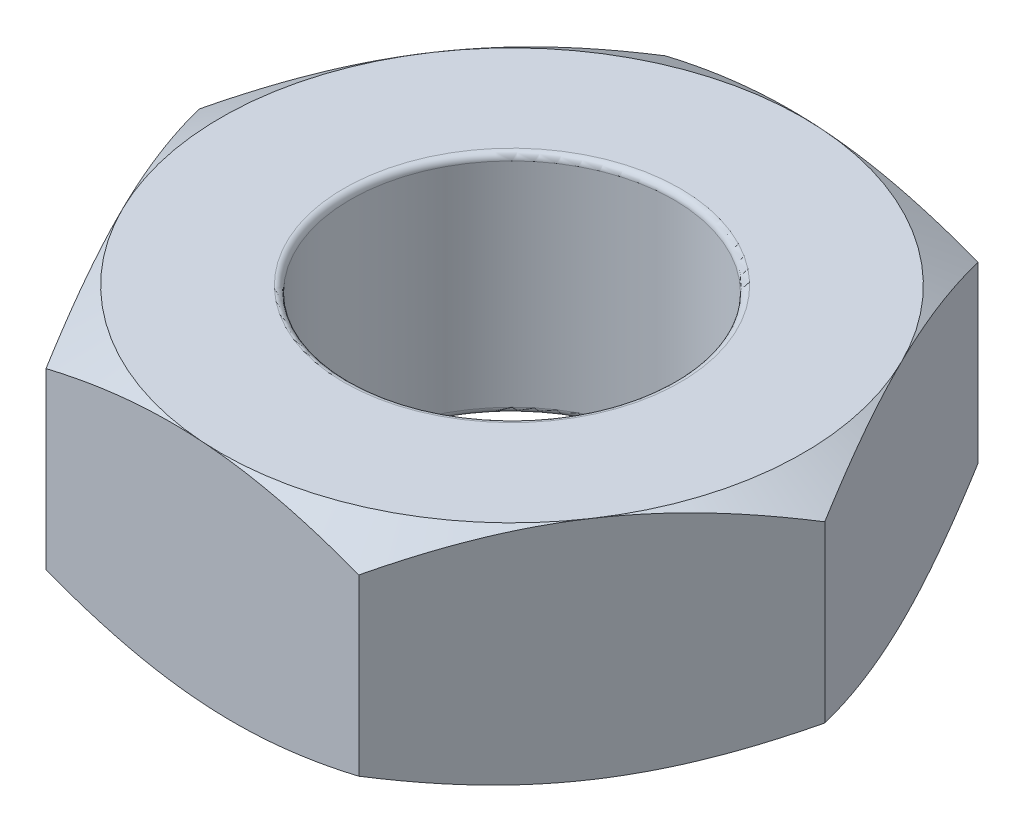
ISO-10303-21;
HEADER;
FILE_DESCRIPTION(('STEP AP214'),'2;1');
FILE_NAME('part.step','',(''),(''),'','','');
FILE_SCHEMA(('AUTOMOTIVE_DESIGN { 1 0 10303 214 1 1 1 1 }'));
ENDSEC;
DATA;
#1=APPLICATION_CONTEXT('core data for automotive mechanical design processes');
#2=APPLICATION_PROTOCOL_DEFINITION('international standard','automotive_design',2000,#1);
#3=PRODUCT_CONTEXT('',#1,'mechanical');
#4=PRODUCT('Part','Part','',(#3));
#5=PRODUCT_RELATED_PRODUCT_CATEGORY('part','',(#4));
#6=PRODUCT_DEFINITION_FORMATION('','',#4);
#7=PRODUCT_DEFINITION_CONTEXT('part definition',#1,'design');
#8=PRODUCT_DEFINITION('design','',#6,#7);
#9=PRODUCT_DEFINITION_SHAPE('','',#8);
#10=(LENGTH_UNIT() NAMED_UNIT(*) SI_UNIT(.MILLI.,.METRE.));
#11=(NAMED_UNIT(*) PLANE_ANGLE_UNIT() SI_UNIT($,.RADIAN.));
#12=(NAMED_UNIT(*) SI_UNIT($,.STERADIAN.) SOLID_ANGLE_UNIT());
#13=UNCERTAINTY_MEASURE_WITH_UNIT(LENGTH_MEASURE(1.E-05),#10,'distance_accuracy_value','');
#14=(GEOMETRIC_REPRESENTATION_CONTEXT(3) GLOBAL_UNCERTAINTY_ASSIGNED_CONTEXT((#13)) GLOBAL_UNIT_ASSIGNED_CONTEXT((#10,
#11,#12)) REPRESENTATION_CONTEXT('',''));
#15=CARTESIAN_POINT('',(0.,0.,0.));
#16=DIRECTION('',(0.,0.,1.));
#17=DIRECTION('',(1.,0.,0.));
#18=AXIS2_PLACEMENT_3D('',#15,#16,#17);
#19=CARTESIAN_POINT('',(-1.146252882548,1.75,-2.33154548084536));
#20=DIRECTION('',(0.830790431180641,0.,0.556585356848961));
#21=DIRECTION('',(0.556585356848961,0.,-0.830790431180641));
#22=AXIS2_PLACEMENT_3D('',#19,#20,#21);
#23=PLANE('',#22);
#24=CARTESIAN_POINT('',(-2.5924380471167,0.201031393244862,-0.172888624974969));
#25=CARTESIAN_POINT('',(-2.52889059428543,0.168058173631026,-0.267743107020657));
#26=CARTESIAN_POINT('',(-2.46479460574027,0.138069884332893,-0.363416364150261));
#27=CARTESIAN_POINT('',(-2.33549266517128,0.0857242251932143,-0.556419671973457));
#28=CARTESIAN_POINT('',(-2.27028441508464,0.0633853747016226,-0.653753152884119));
#29=CARTESIAN_POINT('',(-2.14067607597745,0.028610605846782,-0.847213808301055));
#30=CARTESIAN_POINT('',(-2.07629593248273,0.0159432615544224,-0.943311211));
#31=CARTESIAN_POINT('',(-1.94723260791653,0.000819191728099685,-1.13595834723262));
#32=CARTESIAN_POINT('',(-1.88254989617233,-0.00165005583573603,-1.23250738022215));
#33=CARTESIAN_POINT('',(-1.76167952783556,0.00347803138658858,-1.4129252517881));
#34=CARTESIAN_POINT('',(-1.70547380685891,0.0098162441579589,-1.49682105427448));
#35=CARTESIAN_POINT('',(-1.59342855687802,0.0299073942311841,-1.66406606062958));
#36=CARTESIAN_POINT('',(-1.53758941561701,0.0436671992850212,-1.74741468573109));
#37=CARTESIAN_POINT('',(-1.42531301997605,0.0780667237739584,-1.91500471302546));
#38=CARTESIAN_POINT('',(-1.36888998099337,0.0988523083950956,-1.99922489652135));
#39=CARTESIAN_POINT('',(-1.25688559532257,0.146027824736778,-2.16640890652184));
#40=CARTESIAN_POINT('',(-1.20130281291877,0.172406666845707,-2.24937487605596));
#41=CARTESIAN_POINT('',(-1.14611889319618,0.201031393244862,-2.33174548084536));
#42=B_SPLINE_CURVE_WITH_KNOTS('',3,(#24,#25,#26,#27,#28,#29,#30,#31,#32,#33,#34,#35,#36,#37,#38,
#39,#40,#41),.UNSPECIFIED.,.F.,.F.,(4,2,2,2,2,2,2,2,4),(0.,0.356659496712157,0.714176462982408,
1.0628443844209,1.41108405628949,1.71434084543148,2.01787874333305,2.32815094453625,
2.63781363483916),.UNSPECIFIED.);
#43=CARTESIAN_POINT('',(-2.59230405776488,0.200961894323341,-0.173088624974969));
#44=VERTEX_POINT('',#43);
#45=CARTESIAN_POINT('',(-1.86927847015644,0.,-1.25231705291016));
#46=VERTEX_POINT('',#45);
#47=EDGE_CURVE('E67',#44,#46,#42,.T.);
#48=ORIENTED_EDGE('',*,*,#47,.F.);
#49=DIRECTION('',(0.,-1.,0.));
#50=VECTOR('',#49,1.);
#51=CARTESIAN_POINT('',(-2.59230405776488,1.75,-0.173088624974969));
#52=LINE('',#51,#50);
#53=CARTESIAN_POINT('',(-2.59230405776488,1.54903810567666,-0.173088624974969));
#54=VERTEX_POINT('',#53);
#55=EDGE_CURVE('E301',#54,#44,#52,.T.);
#56=ORIENTED_EDGE('',*,*,#55,.F.);
#57=CARTESIAN_POINT('',(-1.14611889319618,1.54896860675514,-2.33174548084536));
#58=CARTESIAN_POINT('',(-1.20966634602745,1.58194182636897,-2.23689099879967));
#59=CARTESIAN_POINT('',(-1.27376233457261,1.61193011566711,-2.14121774167006));
#60=CARTESIAN_POINT('',(-1.4030642751416,1.66427577480679,-1.94821443384687));
#61=CARTESIAN_POINT('',(-1.46827252522824,1.68661462529838,-1.85088095293621));
#62=CARTESIAN_POINT('',(-1.59788086433543,1.72138939415322,-1.65742029751927));
#63=CARTESIAN_POINT('',(-1.66226100783015,1.73405673844558,-1.56132289482033));
#64=CARTESIAN_POINT('',(-1.79132433239635,1.7491808082719,-1.36867575858771));
#65=CARTESIAN_POINT('',(-1.85600704414056,1.75165005583574,-1.27212672559818));
#66=CARTESIAN_POINT('',(-1.97687741247732,1.74652196861341,-1.09170885403223));
#67=CARTESIAN_POINT('',(-2.03308313345398,1.74018375584204,-1.00781305154584));
#68=CARTESIAN_POINT('',(-2.14512838343486,1.72009260576882,-0.840568045190744));
#69=CARTESIAN_POINT('',(-2.20096752469587,1.70633280071498,-0.757219420089231));
#70=CARTESIAN_POINT('',(-2.31324392033683,1.67193327622604,-0.589629392794869));
#71=CARTESIAN_POINT('',(-2.36966695931951,1.6511476916049,-0.505409209298979));
#72=CARTESIAN_POINT('',(-2.48167134499032,1.60397217526322,-0.338225199298481));
#73=CARTESIAN_POINT('',(-2.53725412739411,1.57759333315429,-0.255259229764361));
#74=CARTESIAN_POINT('',(-2.5924380471167,1.54896860675514,-0.172888624974969));
#75=B_SPLINE_CURVE_WITH_KNOTS('',3,(#57,#58,#59,#60,#61,#62,#63,#64,#65,#66,#67,#68,#69,#70,#71,
#72,#73,#74),.UNSPECIFIED.,.F.,.F.,(4,2,2,2,2,2,2,2,4),(0.,0.356659496712157,0.714176462982408,
1.0628443844209,1.41108405628949,1.71434084543148,2.01787874333305,2.32815094453625,
2.63781363483916),.UNSPECIFIED.);
#76=CARTESIAN_POINT('',(-1.86927847015644,1.75,-1.25231705291016));
#77=VERTEX_POINT('',#76);
#78=EDGE_CURVE('E281',#77,#54,#75,.T.);
#79=ORIENTED_EDGE('',*,*,#78,.F.);
#80=CARTESIAN_POINT('',(-1.146252882548,1.54903810567666,-2.33154548084536));
#81=VERTEX_POINT('',#80);
#82=EDGE_CURVE('E287',#81,#77,#75,.T.);
#83=ORIENTED_EDGE('',*,*,#82,.F.);
#84=DIRECTION('',(0.,-1.,0.));
#85=VECTOR('',#84,1.);
#86=CARTESIAN_POINT('',(-1.146252882548,1.75,-2.33154548084536));
#87=LINE('',#86,#85);
#88=CARTESIAN_POINT('',(-1.146252882548,0.200961894323341,-2.33154548084536));
#89=VERTEX_POINT('',#88);
#90=EDGE_CURVE('E289',#81,#89,#87,.T.);
#91=ORIENTED_EDGE('',*,*,#90,.T.);
#92=EDGE_CURVE('E182',#46,#89,#42,.T.);
#93=ORIENTED_EDGE('',*,*,#92,.F.);
#94=EDGE_LOOP('',(#48,#56,#79,#83,#91,#93));
#95=FACE_BOUND('',#94,.T.);
#96=ADVANCED_FACE('F44',(#95),#23,.F.);
#97=CARTESIAN_POINT('',(-2.59230405776488,1.75,-0.173088624974969));
#98=DIRECTION('',(0.897412273995948,0.,-0.441192940198982));
#99=DIRECTION('',(-0.441192940198982,0.,-0.897412273995948));
#100=AXIS2_PLACEMENT_3D('',#97,#98,#99);
#101=PLANE('',#100);
#102=CARTESIAN_POINT('',(-1.44595284963053,0.201026233471374,2.15865685587039));
#103=CARTESIAN_POINT('',(-1.49632538125103,0.168053437593221,2.05619617703882));
#104=CARTESIAN_POINT('',(-1.54713272418329,0.138065598375975,1.95285106653917));
#105=CARTESIAN_POINT('',(-1.64962724045995,0.0857208733789637,1.74437121896393));
#106=CARTESIAN_POINT('',(-1.70131623534273,0.0633825063617968,1.63923277677264));
#107=CARTESIAN_POINT('',(-1.80405361947209,0.0286086933022285,1.43025892176411));
#108=CARTESIAN_POINT('',(-1.85508619892638,0.0159418242466584,1.32645566699013));
#109=CARTESIAN_POINT('',(-1.95739155273864,0.000818672970701214,1.11836058694371));
#110=CARTESIAN_POINT('',(-2.00866395510404,-0.00165013089081417,1.01406951832595));
#111=CARTESIAN_POINT('',(-2.1044738983528,0.00347865770643142,0.819186483698244));
#112=CARTESIAN_POINT('',(-2.14902576257941,0.00981695643022032,0.728565383169478));
#113=CARTESIAN_POINT('',(-2.23783922812825,0.0299078740413769,0.54791359385548));
#114=CARTESIAN_POINT('',(-2.28210052213238,0.0436673597566206,0.457883530173286));
#115=CARTESIAN_POINT('',(-2.37109718799093,0.0780658873096688,0.276859100702225));
#116=CARTESIAN_POINT('',(-2.41582129264599,0.0988507815019012,0.185887653056613));
#117=CARTESIAN_POINT('',(-2.50460235156724,0.146024654631858,0.0053017807206788));
#118=CARTESIAN_POINT('',(-2.54866044375065,0.172402545261852,-0.0843149585598933));
#119=CARTESIAN_POINT('',(-2.59240238335123,0.201026233471374,-0.173288624974969));
#120=B_SPLINE_CURVE_WITH_KNOTS('',3,(#102,#103,#104,#105,#106,#107,#108,#109,#110,#111,#112,
#113,#114,#115,#116,#117,#118,#119),.UNSPECIFIED.,.F.,.F.,(4,2,2,2,2,2,2,2,4),(0.,
0.356658272925144,0.714173981895043,1.06284079647519,1.41107937484174,1.71432825524214,
2.01785821457289,2.32812205703436,2.63777644789828),.UNSPECIFIED.);
#121=CARTESIAN_POINT('',(-1.44605117521688,0.200961894323341,2.15845685587039));
#122=VERTEX_POINT('',#121);
#123=CARTESIAN_POINT('',(-2.01917761649088,0.,0.992684115447709));
#124=VERTEX_POINT('',#123);
#125=EDGE_CURVE('E172',#122,#124,#120,.T.);
#126=ORIENTED_EDGE('',*,*,#125,.F.);
#127=DIRECTION('',(0.,-1.,0.));
#128=VECTOR('',#127,1.);
#129=CARTESIAN_POINT('',(-1.44605117521688,1.75,2.15845685587039));
#130=LINE('',#129,#128);
#131=CARTESIAN_POINT('',(-1.44605117521688,1.54903810567666,2.15845685587039));
#132=VERTEX_POINT('',#131);
#133=EDGE_CURVE('E298',#132,#122,#130,.T.);
#134=ORIENTED_EDGE('',*,*,#133,.F.);
#135=CARTESIAN_POINT('',(-2.59240238335123,1.54897376652863,-0.173288624974969));
#136=CARTESIAN_POINT('',(-2.54202985173074,1.58194656240678,-0.0708279461434034));
#137=CARTESIAN_POINT('',(-2.49122250879848,1.61193440162403,0.0325171643562501));
#138=CARTESIAN_POINT('',(-2.38872799252181,1.66427912662104,0.240997011931491));
#139=CARTESIAN_POINT('',(-2.33703899763904,1.6866174936382,0.346135454122781));
#140=CARTESIAN_POINT('',(-2.23430161350968,1.72139130669777,0.555109309131308));
#141=CARTESIAN_POINT('',(-2.18326903405538,1.73405817575334,0.658912563905291));
#142=CARTESIAN_POINT('',(-2.08096368024312,1.7491813270293,0.867007643951707));
#143=CARTESIAN_POINT('',(-2.02969127787773,1.75165013089081,0.97129871256947));
#144=CARTESIAN_POINT('',(-1.93388133462896,1.74652134229357,1.16618174719717));
#145=CARTESIAN_POINT('',(-1.88932947040236,1.74018304356978,1.25680284772594));
#146=CARTESIAN_POINT('',(-1.80051600485351,1.72009212595862,1.43745463703994));
#147=CARTESIAN_POINT('',(-1.75625471084938,1.70633264024338,1.52748470072213));
#148=CARTESIAN_POINT('',(-1.66725804499083,1.67193411269033,1.70850913019319));
#149=CARTESIAN_POINT('',(-1.62253394033578,1.6511492184981,1.7994805778388));
#150=CARTESIAN_POINT('',(-1.53375288141453,1.60397534536814,1.98006645017474));
#151=CARTESIAN_POINT('',(-1.48969478923111,1.57759745473815,2.06968318945531));
#152=CARTESIAN_POINT('',(-1.44595284963053,1.54897376652863,2.15865685587039));
#153=B_SPLINE_CURVE_WITH_KNOTS('',3,(#135,#136,#137,#138,#139,#140,#141,#142,#143,#144,#145,
#146,#147,#148,#149,#150,#151,#152),.UNSPECIFIED.,.F.,.F.,(4,2,2,2,2,2,2,2,4),(0.,
0.356658272925144,0.714173981895042,1.06284079647519,1.41107937484174,1.71432825524214,
2.01785821457289,2.32812205703436,2.63777644789828),.UNSPECIFIED.);
#154=CARTESIAN_POINT('',(-2.01917761649088,1.75,0.992684115447709));
#155=VERTEX_POINT('',#154);
#156=EDGE_CURVE('E260',#155,#132,#153,.T.);
#157=ORIENTED_EDGE('',*,*,#156,.F.);
#158=EDGE_CURVE('E288',#54,#155,#153,.T.);
#159=ORIENTED_EDGE('',*,*,#158,.F.);
#160=ORIENTED_EDGE('',*,*,#55,.T.);
#161=EDGE_CURVE('E146',#124,#44,#120,.T.);
#162=ORIENTED_EDGE('',*,*,#161,.F.);
#163=EDGE_LOOP('',(#126,#134,#157,#159,#160,#162));
#164=FACE_BOUND('',#163,.T.);
#165=ADVANCED_FACE('F269',(#164),#101,.F.);
#166=CARTESIAN_POINT('',(-1.44605117521688,1.75,2.15845685587039));
#167=DIRECTION('',(0.0666218428153073,0.,-0.997778297047943));
#168=DIRECTION('',(-0.997778297047943,0.,-0.0666218428153073));
#169=AXIS2_PLACEMENT_3D('',#166,#167,#168);
#170=PLANE('',#169);
#171=CARTESIAN_POINT('',(1.146452882548,0.201019761254017,2.33155883488262));
#172=CARTESIAN_POINT('',(1.03253344349587,0.168047496900458,2.32395241270989));
#173=CARTESIAN_POINT('',(0.917630660918283,0.138060222254761,2.31628033250673));
#174=CARTESIAN_POINT('',(0.685835355822913,0.0857166690249652,2.30080331679384));
#175=CARTESIAN_POINT('',(0.568938714053741,0.0633789084666928,2.29299810624093));
#176=CARTESIAN_POINT('',(0.336594173358869,0.0286062943330791,2.27748441796472));
#177=CARTESIAN_POINT('',(0.221182027348621,0.0159400214023207,2.26977832747025));
#178=CARTESIAN_POINT('',(-0.0101854303415599,0.000818022330458276,2.25432987920833));
#179=CARTESIAN_POINT('',(-0.12613990083612,-0.00165022496415024,2.24658757760698));
#180=CARTESIAN_POINT('',(-0.342814750696145,0.00347944339174038,2.23212015750763));
#181=CARTESIAN_POINT('',(-0.443567534611434,0.00981784991315037,2.2253928753518));
#182=CARTESIAN_POINT('',(-0.644416686082511,0.0299084759075088,2.21198214008277));
#183=CARTESIAN_POINT('',(-0.744512358730162,0.0436675610492797,2.20529873336872));
#184=CARTESIAN_POINT('',(-0.945775758804702,0.0780648380767401,2.19186033864325));
#185=CARTESIAN_POINT('',(-1.04691800786674,0.0988488662222932,2.18510705182699));
#186=CARTESIAN_POINT('',(-1.24769382942873,0.146020678174328,2.17170121280966));
#187=CARTESIAN_POINT('',(-1.34732997497577,0.172397375308495,2.16504848880574));
#188=CARTESIAN_POINT('',(-1.44625117521688,0.201019761254017,2.15844350183312));
#189=B_SPLINE_CURVE_WITH_KNOTS('',3,(#171,#172,#173,#174,#175,#176,#177,#178,#179,#180,#181,
#182,#183,#184,#185,#186,#187,#188),.UNSPECIFIED.,.F.,.F.,(4,2,2,2,2,2,2,2,4),(0.,
0.35665673785365,0.714170869714205,1.06283629589498,1.41107350261562,1.71431246246817,
2.01783246383662,2.32808582130437,2.63772980155745),.UNSPECIFIED.);
#190=CARTESIAN_POINT('',(1.146252882548,0.200961894323341,2.33154548084536));
#191=VERTEX_POINT('',#190);
#192=CARTESIAN_POINT('',(-0.149899146334442,0.,2.24500116835787));
#193=VERTEX_POINT('',#192);
#194=EDGE_CURVE('E155',#191,#193,#189,.T.);
#195=ORIENTED_EDGE('',*,*,#194,.F.);
#196=DIRECTION('',(0.,-1.,0.));
#197=VECTOR('',#196,1.);
#198=CARTESIAN_POINT('',(1.146252882548,1.75,2.33154548084536));
#199=LINE('',#198,#197);
#200=CARTESIAN_POINT('',(1.146252882548,1.54903810567666,2.33154548084536));
#201=VERTEX_POINT('',#200);
#202=EDGE_CURVE('E170',#201,#191,#199,.T.);
#203=ORIENTED_EDGE('',*,*,#202,.F.);
#204=CARTESIAN_POINT('',(-1.44625117521688,1.54898023874598,2.15844350183312));
#205=CARTESIAN_POINT('',(-1.33233173616475,1.58195250309954,2.16604992400585));
#206=CARTESIAN_POINT('',(-1.21742895358717,1.61193977774524,2.17372200420901));
#207=CARTESIAN_POINT('',(-0.985633648491796,1.66428333097503,2.1891990199219));
#208=CARTESIAN_POINT('',(-0.868737006722624,1.68662109153331,2.19700423047481));
#209=CARTESIAN_POINT('',(-0.636392466027752,1.72139370566692,2.21251791875102));
#210=CARTESIAN_POINT('',(-0.520980320017504,1.73405997859768,2.22022400924549));
#211=CARTESIAN_POINT('',(-0.289612862327323,1.74918197766954,2.23567245750742));
#212=CARTESIAN_POINT('',(-0.173658391832763,1.75165022496415,2.24341475910876));
#213=CARTESIAN_POINT('',(0.0430164580272621,1.74652055660826,2.25788217920811));
#214=CARTESIAN_POINT('',(0.143769241942551,1.74018215008685,2.26460946136394));
#215=CARTESIAN_POINT('',(0.344618393413628,1.72009152409249,2.27802019663297));
#216=CARTESIAN_POINT('',(0.444714066061279,1.70633243895072,2.28470360334702));
#217=CARTESIAN_POINT('',(0.645977466135819,1.67193516192326,2.2981419980725));
#218=CARTESIAN_POINT('',(0.747119715197861,1.65115113377771,2.30489528488875));
#219=CARTESIAN_POINT('',(0.947895536759845,1.60397932182567,2.31830112390609));
#220=CARTESIAN_POINT('',(1.04753168230689,1.5776026246915,2.32495384791));
#221=CARTESIAN_POINT('',(1.146452882548,1.54898023874598,2.33155883488262));
#222=B_SPLINE_CURVE_WITH_KNOTS('',3,(#204,#205,#206,#207,#208,#209,#210,#211,#212,#213,#214,
#215,#216,#217,#218,#219,#220,#221),.UNSPECIFIED.,.F.,.F.,(4,2,2,2,2,2,2,2,4),(0.,
0.35665673785365,0.714170869714205,1.06283629589498,1.41107350261562,1.71431246246817,
2.01783246383662,2.32808582130437,2.63772980155745),.UNSPECIFIED.);
#223=CARTESIAN_POINT('',(-0.149899146334442,1.75,2.24500116835787));
#224=VERTEX_POINT('',#223);
#225=EDGE_CURVE('E253',#224,#201,#222,.T.);
#226=ORIENTED_EDGE('',*,*,#225,.F.);
#227=EDGE_CURVE('E259',#132,#224,#222,.T.);
#228=ORIENTED_EDGE('',*,*,#227,.F.);
#229=ORIENTED_EDGE('',*,*,#133,.T.);
#230=EDGE_CURVE('E171',#193,#122,#189,.T.);
#231=ORIENTED_EDGE('',*,*,#230,.F.);
#232=EDGE_LOOP('',(#195,#203,#226,#228,#229,#231));
#233=FACE_BOUND('',#232,.T.);
#234=ADVANCED_FACE('F266',(#233),#170,.F.);
#235=CARTESIAN_POINT('',(1.146252882548,1.75,2.33154548084536));
#236=DIRECTION('',(-0.830790431180641,0.,-0.556585356848961));
#237=DIRECTION('',(-0.556585356848961,0.,0.830790431180641));
#238=AXIS2_PLACEMENT_3D('',#235,#236,#237);
#239=PLANE('',#238);
#240=CARTESIAN_POINT('',(2.5924380471167,0.201031393244861,0.172888624974969));
#241=CARTESIAN_POINT('',(2.52889059428543,0.168058173631025,0.267743107020657));
#242=CARTESIAN_POINT('',(2.46479460574027,0.138069884332892,0.363416364150261));
#243=CARTESIAN_POINT('',(2.33549266517128,0.0857242251932138,0.556419671973457));
#244=CARTESIAN_POINT('',(2.27028441508464,0.0633853747016222,0.653753152884119));
#245=CARTESIAN_POINT('',(2.14067607597745,0.0286106058467816,0.847213808301055));
#246=CARTESIAN_POINT('',(2.07629593248273,0.0159432615544217,0.943311211));
#247=CARTESIAN_POINT('',(1.94723260791653,0.000819191728099189,1.13595834723262));
#248=CARTESIAN_POINT('',(1.88254989617233,-0.00165005583573623,1.23250738022215));
#249=CARTESIAN_POINT('',(1.76167952783556,0.00347803138658841,1.4129252517881));
#250=CARTESIAN_POINT('',(1.70547380685891,0.00981624415795852,1.49682105427448));
#251=CARTESIAN_POINT('',(1.59342855687802,0.0299073942311836,1.66406606062958));
#252=CARTESIAN_POINT('',(1.53758941561701,0.0436671992850208,1.74741468573109));
#253=CARTESIAN_POINT('',(1.42531301997605,0.0780667237739579,1.91500471302546));
#254=CARTESIAN_POINT('',(1.36888998099337,0.0988523083950951,1.99922489652135));
#255=CARTESIAN_POINT('',(1.25688559532257,0.146027824736777,2.16640890652184));
#256=CARTESIAN_POINT('',(1.20130281291877,0.172406666845706,2.24937487605596));
#257=CARTESIAN_POINT('',(1.14611889319618,0.201031393244861,2.33174548084536));
#258=B_SPLINE_CURVE_WITH_KNOTS('',3,(#240,#241,#242,#243,#244,#245,#246,#247,#248,#249,#250,
#251,#252,#253,#254,#255,#256,#257),.UNSPECIFIED.,.F.,.F.,(4,2,2,2,2,2,2,2,4),(0.,
0.356659496712156,0.714176462982408,1.0628443844209,1.41108405628949,1.71434084543148,
2.01787874333305,2.32815094453624,2.63781363483916),.UNSPECIFIED.);
#259=CARTESIAN_POINT('',(2.59230405776488,0.200961894323341,0.173088624974969));
#260=VERTEX_POINT('',#259);
#261=CARTESIAN_POINT('',(1.86927847015644,0.,1.25231705291016));
#262=VERTEX_POINT('',#261);
#263=EDGE_CURVE('E134',#260,#262,#258,.T.);
#264=ORIENTED_EDGE('',*,*,#263,.F.);
#265=DIRECTION('',(0.,-1.,0.));
#266=VECTOR('',#265,1.);
#267=CARTESIAN_POINT('',(2.59230405776488,1.75,0.173088624974969));
#268=LINE('',#267,#266);
#269=CARTESIAN_POINT('',(2.59230405776488,1.54903810567666,0.173088624974969));
#270=VERTEX_POINT('',#269);
#271=EDGE_CURVE('E295',#270,#260,#268,.T.);
#272=ORIENTED_EDGE('',*,*,#271,.F.);
#273=CARTESIAN_POINT('',(1.14611889319618,1.54896860675514,2.33174548084536));
#274=CARTESIAN_POINT('',(1.20966634602745,1.58194182636897,2.23689099879967));
#275=CARTESIAN_POINT('',(1.27376233457261,1.61193011566711,2.14121774167006));
#276=CARTESIAN_POINT('',(1.4030642751416,1.66427577480679,1.94821443384687));
#277=CARTESIAN_POINT('',(1.46827252522824,1.68661462529838,1.85088095293621));
#278=CARTESIAN_POINT('',(1.59788086433543,1.72138939415322,1.65742029751927));
#279=CARTESIAN_POINT('',(1.66226100783015,1.73405673844558,1.56132289482033));
#280=CARTESIAN_POINT('',(1.79132433239635,1.7491808082719,1.36867575858771));
#281=CARTESIAN_POINT('',(1.85600704414056,1.75165005583574,1.27212672559818));
#282=CARTESIAN_POINT('',(1.97687741247732,1.74652196861341,1.09170885403223));
#283=CARTESIAN_POINT('',(2.03308313345397,1.74018375584204,1.00781305154584));
#284=CARTESIAN_POINT('',(2.14512838343486,1.72009260576882,0.840568045190744));
#285=CARTESIAN_POINT('',(2.20096752469587,1.70633280071498,0.757219420089232));
#286=CARTESIAN_POINT('',(2.31324392033683,1.67193327622604,0.58962939279487));
#287=CARTESIAN_POINT('',(2.36966695931951,1.65114769160491,0.50540920929898));
#288=CARTESIAN_POINT('',(2.48167134499031,1.60397217526322,0.338225199298481));
#289=CARTESIAN_POINT('',(2.53725412739411,1.57759333315429,0.255259229764362));
#290=CARTESIAN_POINT('',(2.5924380471167,1.54896860675514,0.17288862497497));
#291=B_SPLINE_CURVE_WITH_KNOTS('',3,(#273,#274,#275,#276,#277,#278,#279,#280,#281,#282,#283,
#284,#285,#286,#287,#288,#289,#290),.UNSPECIFIED.,.F.,.F.,(4,2,2,2,2,2,2,2,4),(0.,
0.356659496712157,0.714176462982408,1.0628443844209,1.41108405628949,1.71434084543148,
2.01787874333305,2.32815094453624,2.63781363483916),.UNSPECIFIED.);
#292=CARTESIAN_POINT('',(1.86927847015644,1.75,1.25231705291016));
#293=VERTEX_POINT('',#292);
#294=EDGE_CURVE('E246',#293,#270,#291,.T.);
#295=ORIENTED_EDGE('',*,*,#294,.F.);
#296=EDGE_CURVE('E252',#201,#293,#291,.T.);
#297=ORIENTED_EDGE('',*,*,#296,.F.);
#298=ORIENTED_EDGE('',*,*,#202,.T.);
#299=EDGE_CURVE('E148',#262,#191,#258,.T.);
#300=ORIENTED_EDGE('',*,*,#299,.F.);
#301=EDGE_LOOP('',(#264,#272,#295,#297,#298,#300));
#302=FACE_BOUND('',#301,.T.);
#303=ADVANCED_FACE('F167',(#302),#239,.F.);
#304=CARTESIAN_POINT('',(2.59230405776488,1.75,0.173088624974969));
#305=DIRECTION('',(-0.897412273995948,0.,0.441192940198982));
#306=DIRECTION('',(0.441192940198982,0.,0.897412273995948));
#307=AXIS2_PLACEMENT_3D('',#304,#305,#306);
#308=PLANE('',#307);
#309=CARTESIAN_POINT('',(1.44595284963053,0.201026233471374,-2.15865685587039));
#310=CARTESIAN_POINT('',(1.49632538125103,0.168053437593221,-2.05619617703882));
#311=CARTESIAN_POINT('',(1.54713272418328,0.138065598375975,-1.95285106653917));
#312=CARTESIAN_POINT('',(1.64962724045995,0.0857208733789636,-1.74437121896393));
#313=CARTESIAN_POINT('',(1.70131623534272,0.0633825063617968,-1.63923277677264));
#314=CARTESIAN_POINT('',(1.80405361947209,0.0286086933022282,-1.43025892176411));
#315=CARTESIAN_POINT('',(1.85508619892638,0.0159418242466579,-1.32645566699013));
#316=CARTESIAN_POINT('',(1.95739155273864,0.000818672970700607,-1.11836058694371));
#317=CARTESIAN_POINT('',(2.00866395510404,-0.00165013089081459,-1.01406951832595));
#318=CARTESIAN_POINT('',(2.1044738983528,0.00347865770643091,-0.819186483698245));
#319=CARTESIAN_POINT('',(2.1490257625794,0.0098169564302196,-0.728565383169479));
#320=CARTESIAN_POINT('',(2.23783922812825,0.029907874041376,-0.54791359385548));
#321=CARTESIAN_POINT('',(2.28210052213238,0.0436673597566197,-0.457883530173287));
#322=CARTESIAN_POINT('',(2.37109718799093,0.0780658873096681,-0.276859100702225));
#323=CARTESIAN_POINT('',(2.41582129264599,0.0988507815019006,-0.185887653056613));
#324=CARTESIAN_POINT('',(2.50460235156724,0.146024654631857,-0.00530178072067859));
#325=CARTESIAN_POINT('',(2.54866044375065,0.172402545261851,0.0843149585598937));
#326=CARTESIAN_POINT('',(2.59240238335123,0.201026233471373,0.17328862497497));
#327=B_SPLINE_CURVE_WITH_KNOTS('',3,(#309,#310,#311,#312,#313,#314,#315,#316,#317,#318,#319,
#320,#321,#322,#323,#324,#325,#326),.UNSPECIFIED.,.F.,.F.,(4,2,2,2,2,2,2,2,4),(0.,
0.356658272925145,0.714173981895043,1.06284079647519,1.41107937484174,1.71432825524214,
2.0178582145729,2.32812205703436,2.63777644789828),.UNSPECIFIED.);
#328=CARTESIAN_POINT('',(1.44605117521688,0.200961894323341,-2.15845685587039));
#329=VERTEX_POINT('',#328);
#330=CARTESIAN_POINT('',(2.01917761649088,0.,-0.992684115447709));
#331=VERTEX_POINT('',#330);
#332=EDGE_CURVE('E59',#329,#331,#327,.T.);
#333=ORIENTED_EDGE('',*,*,#332,.F.);
#334=DIRECTION('',(0.,-1.,0.));
#335=VECTOR('',#334,1.);
#336=CARTESIAN_POINT('',(1.44605117521688,1.75,-2.15845685587039));
#337=LINE('',#336,#335);
#338=CARTESIAN_POINT('',(1.44605117521688,1.54903810567666,-2.15845685587039));
#339=VERTEX_POINT('',#338);
#340=EDGE_CURVE('E292',#339,#329,#337,.T.);
#341=ORIENTED_EDGE('',*,*,#340,.F.);
#342=CARTESIAN_POINT('',(2.59240238335123,1.54897376652863,0.173288624974969));
#343=CARTESIAN_POINT('',(2.54202985173074,1.58194656240678,0.0708279461434037));
#344=CARTESIAN_POINT('',(2.49122250879848,1.61193440162403,-0.0325171643562498));
#345=CARTESIAN_POINT('',(2.38872799252181,1.66427912662104,-0.240997011931491));
#346=CARTESIAN_POINT('',(2.33703899763904,1.6866174936382,-0.346135454122781));
#347=CARTESIAN_POINT('',(2.23430161350967,1.72139130669777,-0.555109309131308));
#348=CARTESIAN_POINT('',(2.18326903405538,1.73405817575334,-0.658912563905291));
#349=CARTESIAN_POINT('',(2.08096368024312,1.7491813270293,-0.867007643951707));
#350=CARTESIAN_POINT('',(2.02969127787772,1.75165013089081,-0.971298712569469));
#351=CARTESIAN_POINT('',(1.93388133462896,1.74652134229357,-1.16618174719717));
#352=CARTESIAN_POINT('',(1.88932947040236,1.74018304356978,-1.25680284772594));
#353=CARTESIAN_POINT('',(1.80051600485351,1.72009212595862,-1.43745463703994));
#354=CARTESIAN_POINT('',(1.75625471084938,1.70633264024338,-1.52748470072213));
#355=CARTESIAN_POINT('',(1.66725804499083,1.67193411269033,-1.70850913019319));
#356=CARTESIAN_POINT('',(1.62253394033578,1.6511492184981,-1.7994805778388));
#357=CARTESIAN_POINT('',(1.53375288141452,1.60397534536814,-1.98006645017474));
#358=CARTESIAN_POINT('',(1.48969478923111,1.57759745473815,-2.06968318945531));
#359=CARTESIAN_POINT('',(1.44595284963053,1.54897376652863,-2.15865685587039));
#360=B_SPLINE_CURVE_WITH_KNOTS('',3,(#342,#343,#344,#345,#346,#347,#348,#349,#350,#351,#352,
#353,#354,#355,#356,#357,#358,#359),.UNSPECIFIED.,.F.,.F.,(4,2,2,2,2,2,2,2,4),(0.,
0.356658272925144,0.714173981895042,1.06284079647519,1.41107937484174,1.71432825524214,
2.01785821457289,2.32812205703436,2.63777644789828),.UNSPECIFIED.);
#361=CARTESIAN_POINT('',(2.01917761649088,1.75,-0.992684115447708));
#362=VERTEX_POINT('',#361);
#363=EDGE_CURVE('E238',#362,#339,#360,.T.);
#364=ORIENTED_EDGE('',*,*,#363,.F.);
#365=EDGE_CURVE('E244',#270,#362,#360,.T.);
#366=ORIENTED_EDGE('',*,*,#365,.F.);
#367=ORIENTED_EDGE('',*,*,#271,.T.);
#368=EDGE_CURVE('E141',#331,#260,#327,.T.);
#369=ORIENTED_EDGE('',*,*,#368,.F.);
#370=EDGE_LOOP('',(#333,#341,#364,#366,#367,#369));
#371=FACE_BOUND('',#370,.T.);
#372=ADVANCED_FACE('F229',(#371),#308,.F.);
#373=CARTESIAN_POINT('',(1.44605117521688,1.75,-2.15845685587039));
#374=DIRECTION('',(-0.0666218428153072,0.,0.997778297047943));
#375=DIRECTION('',(0.997778297047943,0.,0.0666218428153072));
#376=AXIS2_PLACEMENT_3D('',#373,#374,#375);
#377=PLANE('',#376);
#378=CARTESIAN_POINT('',(-1.146452882548,0.201019761254018,-2.33155883488262));
#379=CARTESIAN_POINT('',(-1.03253344349587,0.168047496900458,-2.32395241270989));
#380=CARTESIAN_POINT('',(-0.917630660918283,0.138060222254761,-2.31628033250673));
#381=CARTESIAN_POINT('',(-0.685835355822914,0.0857166690249658,-2.30080331679384));
#382=CARTESIAN_POINT('',(-0.568938714053742,0.0633789084666935,-2.29299810624093));
#383=CARTESIAN_POINT('',(-0.336594173358869,0.0286062943330799,-2.27748441796472));
#384=CARTESIAN_POINT('',(-0.221182027348621,0.0159400214023216,-2.26977832747025));
#385=CARTESIAN_POINT('',(0.0101854303415599,0.000818022330459001,-2.25432987920833));
#386=CARTESIAN_POINT('',(0.12613990083612,-0.00165022496414971,-2.24658757760698));
#387=CARTESIAN_POINT('',(0.342814750696145,0.00347944339174101,-2.23212015750763));
#388=CARTESIAN_POINT('',(0.443567534611434,0.00981784991315123,-2.2253928753518));
#389=CARTESIAN_POINT('',(0.644416686082511,0.0299084759075096,-2.21198214008277));
#390=CARTESIAN_POINT('',(0.744512358730161,0.0436675610492803,-2.20529873336872));
#391=CARTESIAN_POINT('',(0.945775758804701,0.0780648380767404,-2.19186033864325));
#392=CARTESIAN_POINT('',(1.04691800786674,0.0988488662222936,-2.18510705182699));
#393=CARTESIAN_POINT('',(1.24769382942873,0.146020678174329,-2.17170121280966));
#394=CARTESIAN_POINT('',(1.34732997497577,0.172397375308495,-2.16504848880574));
#395=CARTESIAN_POINT('',(1.44625117521688,0.201019761254017,-2.15844350183312));
#396=B_SPLINE_CURVE_WITH_KNOTS('',3,(#378,#379,#380,#381,#382,#383,#384,#385,#386,#387,#388,
#389,#390,#391,#392,#393,#394,#395),.UNSPECIFIED.,.F.,.F.,(4,2,2,2,2,2,2,2,4),(0.,
0.35665673785365,0.714170869714205,1.06283629589498,1.41107350261562,1.71431246246817,
2.01783246383662,2.32808582130437,2.63772980155745),.UNSPECIFIED.);
#397=CARTESIAN_POINT('',(0.149899146334441,0.,-2.24500116835787));
#398=VERTEX_POINT('',#397);
#399=EDGE_CURVE('E228',#89,#398,#396,.T.);
#400=ORIENTED_EDGE('',*,*,#399,.F.);
#401=ORIENTED_EDGE('',*,*,#90,.F.);
#402=CARTESIAN_POINT('',(1.44625117521688,1.54898023874598,-2.15844350183312));
#403=CARTESIAN_POINT('',(1.33233173616475,1.58195250309954,-2.16604992400585));
#404=CARTESIAN_POINT('',(1.21742895358716,1.61193977774524,-2.17372200420902));
#405=CARTESIAN_POINT('',(0.985633648491794,1.66428333097503,-2.1891990199219));
#406=CARTESIAN_POINT('',(0.868737006722622,1.68662109153331,-2.19700423047481));
#407=CARTESIAN_POINT('',(0.63639246602775,1.72139370566692,-2.21251791875102));
#408=CARTESIAN_POINT('',(0.520980320017502,1.73405997859768,-2.2202240092455));
#409=CARTESIAN_POINT('',(0.289612862327321,1.74918197766954,-2.23567245750742));
#410=CARTESIAN_POINT('',(0.173658391832761,1.75165022496415,-2.24341475910876));
#411=CARTESIAN_POINT('',(-0.0430164580272641,1.74652055660826,-2.25788217920811));
#412=CARTESIAN_POINT('',(-0.143769241942553,1.74018215008685,-2.26460946136394));
#413=CARTESIAN_POINT('',(-0.34461839341363,1.72009152409249,-2.27802019663297));
#414=CARTESIAN_POINT('',(-0.44471406606128,1.70633243895072,-2.28470360334702));
#415=CARTESIAN_POINT('',(-0.64597746613582,1.67193516192326,-2.2981419980725));
#416=CARTESIAN_POINT('',(-0.747119715197862,1.65115113377771,-2.30489528488875));
#417=CARTESIAN_POINT('',(-0.947895536759846,1.60397932182567,-2.31830112390609));
#418=CARTESIAN_POINT('',(-1.04753168230689,1.5776026246915,-2.32495384791));
#419=CARTESIAN_POINT('',(-1.146452882548,1.54898023874598,-2.33155883488262));
#420=B_SPLINE_CURVE_WITH_KNOTS('',3,(#402,#403,#404,#405,#406,#407,#408,#409,#410,#411,#412,
#413,#414,#415,#416,#417,#418,#419),.UNSPECIFIED.,.F.,.F.,(4,2,2,2,2,2,2,2,4),(0.,
0.35665673785365,0.714170869714205,1.06283629589498,1.41107350261562,1.71431246246817,
2.01783246383662,2.32808582130437,2.63772980155745),.UNSPECIFIED.);
#421=CARTESIAN_POINT('',(0.149899146334441,1.75,-2.24500116835787));
#422=VERTEX_POINT('',#421);
#423=EDGE_CURVE('E304',#422,#81,#420,.T.);
#424=ORIENTED_EDGE('',*,*,#423,.F.);
#425=EDGE_CURVE('E160',#339,#422,#420,.T.);
#426=ORIENTED_EDGE('',*,*,#425,.F.);
#427=ORIENTED_EDGE('',*,*,#340,.T.);
#428=EDGE_CURVE('E216',#398,#329,#396,.T.);
#429=ORIENTED_EDGE('',*,*,#428,.F.);
#430=EDGE_LOOP('',(#400,#401,#424,#426,#427,#429));
#431=FACE_BOUND('',#430,.T.);
#432=ADVANCED_FACE('F232',(#431),#377,.F.);
#433=CARTESIAN_POINT('',(0.,0.,0.));
#434=DIRECTION('',(0.,1.,0.));
#435=DIRECTION('',(0.,0.,1.));
#436=AXIS2_PLACEMENT_3D('',#433,#434,#435);
#437=PLANE('',#436);
#438=CARTESIAN_POINT('',(0.,0.,0.));
#439=DIRECTION('',(0.,1.,0.));
#440=DIRECTION('',(0.,0.,1.));
#441=AXIS2_PLACEMENT_3D('',#438,#439,#440);
#442=CIRCLE('',#441,1.3);
#443=CARTESIAN_POINT('',(0.,0.,1.3));
#444=VERTEX_POINT('',#443);
#445=EDGE_CURVE('E164',#444,#444,#442,.T.);
#446=ORIENTED_EDGE('',*,*,#445,.T.);
#447=EDGE_LOOP('',(#446));
#448=FACE_BOUND('',#447,.T.);
#449=CARTESIAN_POINT('',(0.,0.,0.));
#450=DIRECTION('',(0.,1.,0.));
#451=DIRECTION('',(0.,0.,1.));
#452=AXIS2_PLACEMENT_3D('',#449,#450,#451);
#453=CIRCLE('',#452,2.25);
#454=EDGE_CURVE('E138',#262,#331,#453,.T.);
#455=ORIENTED_EDGE('',*,*,#454,.F.);
#456=EDGE_CURVE('E152',#193,#262,#453,.T.);
#457=ORIENTED_EDGE('',*,*,#456,.F.);
#458=EDGE_CURVE('E159',#124,#193,#453,.T.);
#459=ORIENTED_EDGE('',*,*,#458,.F.);
#460=EDGE_CURVE('E395',#46,#124,#453,.T.);
#461=ORIENTED_EDGE('',*,*,#460,.F.);
#462=EDGE_CURVE('E165',#398,#46,#453,.T.);
#463=ORIENTED_EDGE('',*,*,#462,.F.);
#464=CARTESIAN_POINT('',(0.,0.,0.));
#465=DIRECTION('',(0.,-1.,0.));
#466=DIRECTION('',(0.,0.,-1.));
#467=AXIS2_PLACEMENT_3D('',#464,#465,#466);
#468=CIRCLE('',#467,2.25);
#469=EDGE_CURVE('E163',#398,#331,#468,.T.);
#470=ORIENTED_EDGE('',*,*,#469,.T.);
#471=EDGE_LOOP('',(#455,#457,#459,#461,#463,#470));
#472=FACE_BOUND('',#471,.T.);
#473=ADVANCED_FACE('F162',(#448,#472),#437,.F.);
#474=CARTESIAN_POINT('',(0.,1.75,0.));
#475=DIRECTION('',(0.,1.,0.));
#476=DIRECTION('',(0.,0.,1.));
#477=AXIS2_PLACEMENT_3D('',#474,#475,#476);
#478=PLANE('',#477);
#479=CARTESIAN_POINT('',(0.,1.75,0.));
#480=DIRECTION('',(0.,1.,0.));
#481=DIRECTION('',(0.,0.,1.));
#482=AXIS2_PLACEMENT_3D('',#479,#480,#481);
#483=CIRCLE('',#482,1.3);
#484=CARTESIAN_POINT('',(0.,1.75,1.3));
#485=VERTEX_POINT('',#484);
#486=EDGE_CURVE('E12',#485,#485,#483,.F.);
#487=ORIENTED_EDGE('',*,*,#486,.T.);
#488=EDGE_LOOP('',(#487));
#489=FACE_BOUND('',#488,.T.);
#490=CARTESIAN_POINT('',(0.,1.75,0.));
#491=DIRECTION('',(0.,1.,0.));
#492=DIRECTION('',(0.,0.,1.));
#493=AXIS2_PLACEMENT_3D('',#490,#491,#492);
#494=CIRCLE('',#493,2.25);
#495=EDGE_CURVE('E385',#224,#293,#494,.T.);
#496=ORIENTED_EDGE('',*,*,#495,.T.);
#497=EDGE_CURVE('E245',#293,#362,#494,.T.);
#498=ORIENTED_EDGE('',*,*,#497,.T.);
#499=EDGE_CURVE('E381',#362,#422,#494,.T.);
#500=ORIENTED_EDGE('',*,*,#499,.T.);
#501=EDGE_CURVE('E375',#422,#77,#494,.T.);
#502=ORIENTED_EDGE('',*,*,#501,.T.);
#503=EDGE_CURVE('E358',#77,#155,#494,.T.);
#504=ORIENTED_EDGE('',*,*,#503,.T.);
#505=EDGE_CURVE('E386',#155,#224,#494,.T.);
#506=ORIENTED_EDGE('',*,*,#505,.T.);
#507=EDGE_LOOP('',(#496,#498,#500,#502,#504,#506));
#508=FACE_BOUND('',#507,.T.);
#509=ADVANCED_FACE('F325',(#489,#508),#478,.T.);
#510=CARTESIAN_POINT('',(0.,1.75,0.));
#511=DIRECTION('',(0.,-1.,0.));
#512=DIRECTION('',(0.,0.,-1.));
#513=AXIS2_PLACEMENT_3D('',#510,#511,#512);
#514=CYLINDRICAL_SURFACE('',#513,1.25);
#515=CARTESIAN_POINT('',(0.,0.0499999999999999,0.));
#516=DIRECTION('',(0.,1.,0.));
#517=DIRECTION('',(0.,0.,1.));
#518=AXIS2_PLACEMENT_3D('',#515,#516,#517);
#519=CIRCLE('',#518,1.25);
#520=CARTESIAN_POINT('',(0.,0.0499999999999999,1.25));
#521=VERTEX_POINT('',#520);
#522=EDGE_CURVE('E52',#521,#521,#519,.F.);
#523=ORIENTED_EDGE('',*,*,#522,.T.);
#524=EDGE_LOOP('',(#523));
#525=FACE_BOUND('',#524,.T.);
#526=CARTESIAN_POINT('',(0.,1.7,0.));
#527=DIRECTION('',(0.,1.,0.));
#528=DIRECTION('',(0.,0.,1.));
#529=AXIS2_PLACEMENT_3D('',#526,#527,#528);
#530=CIRCLE('',#529,1.25);
#531=CARTESIAN_POINT('',(0.,1.7,1.25));
#532=VERTEX_POINT('',#531);
#533=EDGE_CURVE('E312',#532,#532,#530,.T.);
#534=ORIENTED_EDGE('',*,*,#533,.T.);
#535=EDGE_LOOP('',(#534));
#536=FACE_BOUND('',#535,.T.);
#537=ADVANCED_FACE('F317',(#525,#536),#514,.F.);
#538=CARTESIAN_POINT('',(0.,1.75,0.));
#539=DIRECTION('',(0.,-1.,0.));
#540=DIRECTION('',(0.,0.,1.));
#541=AXIS2_PLACEMENT_3D('',#538,#539,#540);
#542=CONICAL_SURFACE('',#541,2.25,1.0471975511966);
#543=ORIENTED_EDGE('',*,*,#82,.T.);
#544=ORIENTED_EDGE('',*,*,#501,.F.);
#545=ORIENTED_EDGE('',*,*,#423,.T.);
#546=EDGE_LOOP('',(#543,#544,#545));
#547=FACE_BOUND('',#546,.T.);
#548=ADVANCED_FACE('F203',(#547),#542,.T.);
#549=ORIENTED_EDGE('',*,*,#363,.T.);
#550=ORIENTED_EDGE('',*,*,#425,.T.);
#551=ORIENTED_EDGE('',*,*,#499,.F.);
#552=EDGE_LOOP('',(#549,#550,#551));
#553=FACE_BOUND('',#552,.T.);
#554=ADVANCED_FACE('F337',(#553),#542,.T.);
#555=ORIENTED_EDGE('',*,*,#294,.T.);
#556=ORIENTED_EDGE('',*,*,#365,.T.);
#557=ORIENTED_EDGE('',*,*,#497,.F.);
#558=EDGE_LOOP('',(#555,#556,#557));
#559=FACE_BOUND('',#558,.T.);
#560=ADVANCED_FACE('F342',(#559),#542,.T.);
#561=ORIENTED_EDGE('',*,*,#225,.T.);
#562=ORIENTED_EDGE('',*,*,#296,.T.);
#563=ORIENTED_EDGE('',*,*,#495,.F.);
#564=EDGE_LOOP('',(#561,#562,#563));
#565=FACE_BOUND('',#564,.T.);
#566=ADVANCED_FACE('F351',(#565),#542,.T.);
#567=ORIENTED_EDGE('',*,*,#156,.T.);
#568=ORIENTED_EDGE('',*,*,#227,.T.);
#569=ORIENTED_EDGE('',*,*,#505,.F.);
#570=EDGE_LOOP('',(#567,#568,#569));
#571=FACE_BOUND('',#570,.T.);
#572=ADVANCED_FACE('F346',(#571),#542,.T.);
#573=ORIENTED_EDGE('',*,*,#78,.T.);
#574=ORIENTED_EDGE('',*,*,#158,.T.);
#575=ORIENTED_EDGE('',*,*,#503,.F.);
#576=EDGE_LOOP('',(#573,#574,#575));
#577=FACE_BOUND('',#576,.T.);
#578=ADVANCED_FACE('F201',(#577),#542,.T.);
#579=CARTESIAN_POINT('',(0.,0.,0.));
#580=DIRECTION('',(0.,1.,0.));
#581=DIRECTION('',(0.,0.,-1.));
#582=AXIS2_PLACEMENT_3D('',#579,#580,#581);
#583=CONICAL_SURFACE('',#582,2.25,1.0471975511966);
#584=ORIENTED_EDGE('',*,*,#194,.T.);
#585=ORIENTED_EDGE('',*,*,#456,.T.);
#586=ORIENTED_EDGE('',*,*,#299,.T.);
#587=EDGE_LOOP('',(#584,#585,#586));
#588=FACE_BOUND('',#587,.T.);
#589=ADVANCED_FACE('F153',(#588),#583,.T.);
#590=ORIENTED_EDGE('',*,*,#230,.T.);
#591=ORIENTED_EDGE('',*,*,#125,.T.);
#592=ORIENTED_EDGE('',*,*,#458,.T.);
#593=EDGE_LOOP('',(#590,#591,#592));
#594=FACE_BOUND('',#593,.T.);
#595=ADVANCED_FACE('F200',(#594),#583,.T.);
#596=ORIENTED_EDGE('',*,*,#161,.T.);
#597=ORIENTED_EDGE('',*,*,#47,.T.);
#598=ORIENTED_EDGE('',*,*,#460,.T.);
#599=EDGE_LOOP('',(#596,#597,#598));
#600=FACE_BOUND('',#599,.T.);
#601=ADVANCED_FACE('F394',(#600),#583,.T.);
#602=ORIENTED_EDGE('',*,*,#92,.T.);
#603=ORIENTED_EDGE('',*,*,#399,.T.);
#604=ORIENTED_EDGE('',*,*,#462,.T.);
#605=EDGE_LOOP('',(#602,#603,#604));
#606=FACE_BOUND('',#605,.T.);
#607=ADVANCED_FACE('F369',(#606),#583,.T.);
#608=ORIENTED_EDGE('',*,*,#332,.T.);
#609=ORIENTED_EDGE('',*,*,#469,.F.);
#610=ORIENTED_EDGE('',*,*,#428,.T.);
#611=EDGE_LOOP('',(#608,#609,#610));
#612=FACE_BOUND('',#611,.T.);
#613=ADVANCED_FACE('F202',(#612),#583,.T.);
#614=ORIENTED_EDGE('',*,*,#263,.T.);
#615=ORIENTED_EDGE('',*,*,#454,.T.);
#616=ORIENTED_EDGE('',*,*,#368,.T.);
#617=EDGE_LOOP('',(#614,#615,#616));
#618=FACE_BOUND('',#617,.T.);
#619=ADVANCED_FACE('F136',(#618),#583,.T.);
#620=CARTESIAN_POINT('',(0.,0.0499999999999999,0.));
#621=DIRECTION('',(0.,1.,0.));
#622=DIRECTION('',(0.,0.,1.));
#623=AXIS2_PLACEMENT_3D('',#620,#621,#622);
#624=TOROIDAL_SURFACE('',#623,1.3,0.05);
#625=ORIENTED_EDGE('',*,*,#522,.F.);
#626=EDGE_LOOP('',(#625));
#627=FACE_BOUND('',#626,.T.);
#628=ORIENTED_EDGE('',*,*,#445,.F.);
#629=EDGE_LOOP('',(#628));
#630=FACE_BOUND('',#629,.T.);
#631=ADVANCED_FACE('F279',(#627,#630),#624,.T.);
#632=CARTESIAN_POINT('',(0.,1.7,0.));
#633=DIRECTION('',(0.,1.,0.));
#634=DIRECTION('',(0.,0.,1.));
#635=AXIS2_PLACEMENT_3D('',#632,#633,#634);
#636=TOROIDAL_SURFACE('',#635,1.3,0.05);
#637=ORIENTED_EDGE('',*,*,#486,.F.);
#638=EDGE_LOOP('',(#637));
#639=FACE_BOUND('',#638,.T.);
#640=ORIENTED_EDGE('',*,*,#533,.F.);
#641=EDGE_LOOP('',(#640));
#642=FACE_BOUND('',#641,.T.);
#643=ADVANCED_FACE('F46',(#639,#642),#636,.T.);
#644=CLOSED_SHELL('',(#96,#165,#234,#303,#372,#432,#473,#509,#537,#548,#554,#560,#566,#572,#578,
#589,#595,#601,#607,#613,#619,#631,#643));
#645=MANIFOLD_SOLID_BREP('B2',#644);
#646=ADVANCED_BREP_SHAPE_REPRESENTATION('',(#18,#645),#14);
#647=SHAPE_DEFINITION_REPRESENTATION(#9,#646);
ENDSEC;
END-ISO-10303-21;
